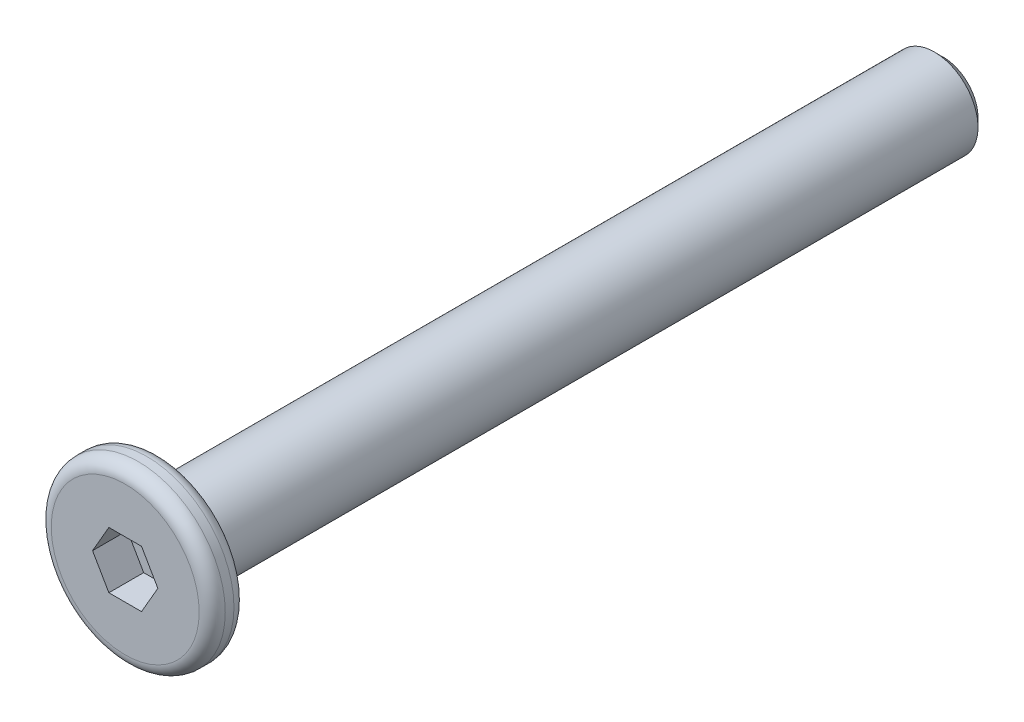
ISO-10303-21;
HEADER;
FILE_DESCRIPTION(('STEP AP214'),'2;1');
FILE_NAME('part.step','',(''),(''),'','','');
FILE_SCHEMA(('AUTOMOTIVE_DESIGN { 1 0 10303 214 1 1 1 1 }'));
ENDSEC;
DATA;
#1=APPLICATION_CONTEXT('core data for automotive mechanical design processes');
#2=APPLICATION_PROTOCOL_DEFINITION('international standard','automotive_design',2000,#1);
#3=PRODUCT_CONTEXT('',#1,'mechanical');
#4=PRODUCT('Part','Part','',(#3));
#5=PRODUCT_RELATED_PRODUCT_CATEGORY('part','',(#4));
#6=PRODUCT_DEFINITION_FORMATION('','',#4);
#7=PRODUCT_DEFINITION_CONTEXT('part definition',#1,'design');
#8=PRODUCT_DEFINITION('design','',#6,#7);
#9=PRODUCT_DEFINITION_SHAPE('','',#8);
#10=(LENGTH_UNIT() NAMED_UNIT(*) SI_UNIT(.MILLI.,.METRE.));
#11=(NAMED_UNIT(*) PLANE_ANGLE_UNIT() SI_UNIT($,.RADIAN.));
#12=(NAMED_UNIT(*) SI_UNIT($,.STERADIAN.) SOLID_ANGLE_UNIT());
#13=UNCERTAINTY_MEASURE_WITH_UNIT(LENGTH_MEASURE(1.E-05),#10,'distance_accuracy_value','');
#14=(GEOMETRIC_REPRESENTATION_CONTEXT(3) GLOBAL_UNCERTAINTY_ASSIGNED_CONTEXT((#13)) GLOBAL_UNIT_ASSIGNED_CONTEXT((#10,
#11,#12)) REPRESENTATION_CONTEXT('',''));
#15=CARTESIAN_POINT('',(0.,0.,0.));
#16=DIRECTION('',(0.,0.,1.));
#17=DIRECTION('',(1.,0.,0.));
#18=AXIS2_PLACEMENT_3D('',#15,#16,#17);
#19=CARTESIAN_POINT('',(0.,0.,0.4));
#20=DIRECTION('',(0.,0.,-1.));
#21=DIRECTION('',(-1.,0.,0.));
#22=AXIS2_PLACEMENT_3D('',#19,#20,#21);
#23=CYLINDRICAL_SURFACE('',#22,2.);
#24=CARTESIAN_POINT('',(0.,0.,-0.1));
#25=DIRECTION('',(0.,0.,1.));
#26=DIRECTION('',(1.,0.,0.));
#27=AXIS2_PLACEMENT_3D('',#24,#25,#26);
#28=CIRCLE('',#27,2.);
#29=CARTESIAN_POINT('',(2.,0.,-0.1));
#30=VERTEX_POINT('',#29);
#31=EDGE_CURVE('E153',#30,#30,#28,.T.);
#32=ORIENTED_EDGE('',*,*,#31,.T.);
#33=EDGE_LOOP('',(#32));
#34=FACE_BOUND('',#33,.T.);
#35=CARTESIAN_POINT('',(0.,0.,0.1));
#36=DIRECTION('',(0.,0.,1.));
#37=DIRECTION('',(1.,0.,0.));
#38=AXIS2_PLACEMENT_3D('',#35,#36,#37);
#39=CIRCLE('',#38,2.);
#40=CARTESIAN_POINT('',(2.,0.,0.1));
#41=VERTEX_POINT('',#40);
#42=EDGE_CURVE('E150',#41,#41,#39,.F.);
#43=ORIENTED_EDGE('',*,*,#42,.T.);
#44=EDGE_LOOP('',(#43));
#45=FACE_BOUND('',#44,.T.);
#46=ADVANCED_FACE('F34',(#34,#45),#23,.T.);
#47=CARTESIAN_POINT('',(0.,0.,0.4));
#48=DIRECTION('',(0.,0.,1.));
#49=DIRECTION('',(1.,0.,0.));
#50=AXIS2_PLACEMENT_3D('',#47,#48,#49);
#51=PLANE('',#50);
#52=CARTESIAN_POINT('',(0.,0.,0.4));
#53=DIRECTION('',(0.,0.,1.));
#54=DIRECTION('',(1.,0.,0.));
#55=AXIS2_PLACEMENT_3D('',#52,#53,#54);
#56=CIRCLE('',#55,1.7);
#57=CARTESIAN_POINT('',(1.7,0.,0.4));
#58=VERTEX_POINT('',#57);
#59=EDGE_CURVE('E11',#58,#58,#56,.T.);
#60=ORIENTED_EDGE('',*,*,#59,.T.);
#61=EDGE_LOOP('',(#60));
#62=FACE_BOUND('',#61,.T.);
#63=DIRECTION('',(0.5,0.866025403784439,0.));
#64=VECTOR('',#63,1.);
#65=CARTESIAN_POINT('',(0.375277674973257,-0.65,0.4));
#66=LINE('',#65,#64);
#67=CARTESIAN_POINT('',(0.375277674973257,-0.65,0.4));
#68=VERTEX_POINT('',#67);
#69=CARTESIAN_POINT('',(0.750555349946514,0.,0.4));
#70=VERTEX_POINT('',#69);
#71=EDGE_CURVE('E49',#68,#70,#66,.T.);
#72=ORIENTED_EDGE('',*,*,#71,.F.);
#73=DIRECTION('',(1.,0.,0.));
#74=VECTOR('',#73,1.);
#75=CARTESIAN_POINT('',(-0.375277674973256,-0.65,0.4));
#76=LINE('',#75,#74);
#77=CARTESIAN_POINT('',(-0.375277674973256,-0.65,0.4));
#78=VERTEX_POINT('',#77);
#79=EDGE_CURVE('E132',#78,#68,#76,.T.);
#80=ORIENTED_EDGE('',*,*,#79,.F.);
#81=DIRECTION('',(0.5,-0.866025403784438,0.));
#82=VECTOR('',#81,1.);
#83=CARTESIAN_POINT('',(-0.750555349946513,0.,0.4));
#84=LINE('',#83,#82);
#85=CARTESIAN_POINT('',(-0.750555349946513,0.,0.4));
#86=VERTEX_POINT('',#85);
#87=EDGE_CURVE('E130',#86,#78,#84,.T.);
#88=ORIENTED_EDGE('',*,*,#87,.F.);
#89=DIRECTION('',(-0.5,-0.866025403784439,0.));
#90=VECTOR('',#89,1.);
#91=CARTESIAN_POINT('',(-0.375277674973257,0.65,0.4));
#92=LINE('',#91,#90);
#93=CARTESIAN_POINT('',(-0.375277674973257,0.65,0.4));
#94=VERTEX_POINT('',#93);
#95=EDGE_CURVE('E97',#94,#86,#92,.T.);
#96=ORIENTED_EDGE('',*,*,#95,.F.);
#97=DIRECTION('',(-1.,0.,0.));
#98=VECTOR('',#97,1.);
#99=CARTESIAN_POINT('',(0.375277674973257,0.65,0.4));
#100=LINE('',#99,#98);
#101=CARTESIAN_POINT('',(0.375277674973257,0.65,0.4));
#102=VERTEX_POINT('',#101);
#103=EDGE_CURVE('E126',#102,#94,#100,.T.);
#104=ORIENTED_EDGE('',*,*,#103,.F.);
#105=DIRECTION('',(-0.5,0.866025403784439,0.));
#106=VECTOR('',#105,1.);
#107=CARTESIAN_POINT('',(0.750555349946514,0.,0.4));
#108=LINE('',#107,#106);
#109=EDGE_CURVE('E123',#70,#102,#108,.T.);
#110=ORIENTED_EDGE('',*,*,#109,.F.);
#111=EDGE_LOOP('',(#72,#80,#88,#96,#104,#110));
#112=FACE_BOUND('',#111,.T.);
#113=ADVANCED_FACE('F168',(#62,#112),#51,.T.);
#114=CARTESIAN_POINT('',(0.,0.,-0.4));
#115=DIRECTION('',(0.,0.,1.));
#116=DIRECTION('',(1.,0.,0.));
#117=AXIS2_PLACEMENT_3D('',#114,#115,#116);
#118=PLANE('',#117);
#119=CARTESIAN_POINT('',(0.,0.,-0.4));
#120=DIRECTION('',(0.,0.,1.));
#121=DIRECTION('',(1.,0.,0.));
#122=AXIS2_PLACEMENT_3D('',#119,#120,#121);
#123=CIRCLE('',#122,1.7);
#124=CARTESIAN_POINT('',(1.7,0.,-0.4));
#125=VERTEX_POINT('',#124);
#126=EDGE_CURVE('E42',#125,#125,#123,.F.);
#127=ORIENTED_EDGE('',*,*,#126,.T.);
#128=EDGE_LOOP('',(#127));
#129=FACE_BOUND('',#128,.T.);
#130=CARTESIAN_POINT('',(0.,0.,-0.4));
#131=DIRECTION('',(0.,0.,-1.));
#132=DIRECTION('',(-1.,0.,0.));
#133=AXIS2_PLACEMENT_3D('',#130,#131,#132);
#134=CIRCLE('',#133,1.);
#135=CARTESIAN_POINT('',(-1.,0.,-0.4));
#136=VERTEX_POINT('',#135);
#137=EDGE_CURVE('E136',#136,#136,#134,.T.);
#138=ORIENTED_EDGE('',*,*,#137,.F.);
#139=EDGE_LOOP('',(#138));
#140=FACE_BOUND('',#139,.T.);
#141=ADVANCED_FACE('F158',(#129,#140),#118,.F.);
#142=CARTESIAN_POINT('',(0.,0.,-18.4));
#143=DIRECTION('',(0.,0.,1.));
#144=DIRECTION('',(1.,0.,0.));
#145=AXIS2_PLACEMENT_3D('',#142,#143,#144);
#146=CYLINDRICAL_SURFACE('',#145,1.);
#147=CARTESIAN_POINT('',(0.,0.,-18.2));
#148=DIRECTION('',(0.,0.,-1.));
#149=DIRECTION('',(-1.,0.,0.));
#150=AXIS2_PLACEMENT_3D('',#147,#148,#149);
#151=CIRCLE('',#150,1.);
#152=CARTESIAN_POINT('',(-1.,0.,-18.2));
#153=VERTEX_POINT('',#152);
#154=EDGE_CURVE('E147',#153,#153,#151,.F.);
#155=ORIENTED_EDGE('',*,*,#154,.T.);
#156=EDGE_LOOP('',(#155));
#157=FACE_BOUND('',#156,.T.);
#158=ORIENTED_EDGE('',*,*,#137,.T.);
#159=EDGE_LOOP('',(#158));
#160=FACE_BOUND('',#159,.T.);
#161=ADVANCED_FACE('F203',(#157,#160),#146,.T.);
#162=CARTESIAN_POINT('',(0.,0.,-18.4));
#163=DIRECTION('',(0.,0.,-1.));
#164=DIRECTION('',(-1.,0.,0.));
#165=AXIS2_PLACEMENT_3D('',#162,#163,#164);
#166=PLANE('',#165);
#167=CARTESIAN_POINT('',(0.,0.,-18.4));
#168=DIRECTION('',(0.,0.,-1.));
#169=DIRECTION('',(-1.,0.,0.));
#170=AXIS2_PLACEMENT_3D('',#167,#168,#169);
#171=CIRCLE('',#170,0.799999999999999);
#172=CARTESIAN_POINT('',(-0.799999999999999,0.,-18.4));
#173=VERTEX_POINT('',#172);
#174=EDGE_CURVE('E144',#173,#173,#171,.T.);
#175=ORIENTED_EDGE('',*,*,#174,.T.);
#176=EDGE_LOOP('',(#175));
#177=FACE_BOUND('',#176,.T.);
#178=ADVANCED_FACE('F195',(#177),#166,.T.);
#179=CARTESIAN_POINT('',(0.,0.,-18.4));
#180=DIRECTION('',(0.,0.,1.));
#181=DIRECTION('',(1.,0.,0.));
#182=AXIS2_PLACEMENT_3D('',#179,#180,#181);
#183=CONICAL_SURFACE('',#182,0.799999999999999,0.785398163397446);
#184=ORIENTED_EDGE('',*,*,#154,.F.);
#185=EDGE_LOOP('',(#184));
#186=FACE_BOUND('',#185,.T.);
#187=ORIENTED_EDGE('',*,*,#174,.F.);
#188=EDGE_LOOP('',(#187));
#189=FACE_BOUND('',#188,.T.);
#190=ADVANCED_FACE('F188',(#186,#189),#183,.T.);
#191=CARTESIAN_POINT('',(0.375277674973257,-0.65,-0.4));
#192=DIRECTION('',(0.866025403784439,-0.5,0.));
#193=DIRECTION('',(0.5,0.866025403784439,0.));
#194=AXIS2_PLACEMENT_3D('',#191,#192,#193);
#195=PLANE('',#194);
#196=ORIENTED_EDGE('',*,*,#71,.T.);
#197=DIRECTION('',(0.,0.,1.));
#198=VECTOR('',#197,1.);
#199=CARTESIAN_POINT('',(0.750555349946514,0.,-0.4));
#200=LINE('',#199,#198);
#201=CARTESIAN_POINT('',(0.750555349946514,0.,-0.4));
#202=VERTEX_POINT('',#201);
#203=EDGE_CURVE('E79',#202,#70,#200,.T.);
#204=ORIENTED_EDGE('',*,*,#203,.F.);
#205=DIRECTION('',(0.5,0.866025403784439,0.));
#206=VECTOR('',#205,1.);
#207=CARTESIAN_POINT('',(0.375277674973257,-0.65,-0.4));
#208=LINE('',#207,#206);
#209=CARTESIAN_POINT('',(0.375277674973257,-0.65,-0.4));
#210=VERTEX_POINT('',#209);
#211=EDGE_CURVE('E134',#210,#202,#208,.T.);
#212=ORIENTED_EDGE('',*,*,#211,.F.);
#213=DIRECTION('',(0.,0.,1.));
#214=VECTOR('',#213,1.);
#215=CARTESIAN_POINT('',(0.375277674973257,-0.65,-0.4));
#216=LINE('',#215,#214);
#217=EDGE_CURVE('E57',#210,#68,#216,.T.);
#218=ORIENTED_EDGE('',*,*,#217,.T.);
#219=EDGE_LOOP('',(#196,#204,#212,#218));
#220=FACE_BOUND('',#219,.T.);
#221=ADVANCED_FACE('F185',(#220),#195,.F.);
#222=CARTESIAN_POINT('',(-0.375277674973256,-0.65,-0.4));
#223=DIRECTION('',(0.,-1.,0.));
#224=DIRECTION('',(1.,0.,0.));
#225=AXIS2_PLACEMENT_3D('',#222,#223,#224);
#226=PLANE('',#225);
#227=ORIENTED_EDGE('',*,*,#79,.T.);
#228=ORIENTED_EDGE('',*,*,#217,.F.);
#229=DIRECTION('',(1.,0.,0.));
#230=VECTOR('',#229,1.);
#231=CARTESIAN_POINT('',(-0.375277674973256,-0.65,-0.4));
#232=LINE('',#231,#230);
#233=CARTESIAN_POINT('',(-0.375277674973256,-0.65,-0.4));
#234=VERTEX_POINT('',#233);
#235=EDGE_CURVE('E109',#234,#210,#232,.T.);
#236=ORIENTED_EDGE('',*,*,#235,.F.);
#237=DIRECTION('',(0.,0.,1.));
#238=VECTOR('',#237,1.);
#239=CARTESIAN_POINT('',(-0.375277674973256,-0.65,-0.4));
#240=LINE('',#239,#238);
#241=EDGE_CURVE('E101',#234,#78,#240,.T.);
#242=ORIENTED_EDGE('',*,*,#241,.T.);
#243=EDGE_LOOP('',(#227,#228,#236,#242));
#244=FACE_BOUND('',#243,.T.);
#245=ADVANCED_FACE('F187',(#244),#226,.F.);
#246=CARTESIAN_POINT('',(-0.750555349946513,0.,-0.4));
#247=DIRECTION('',(-0.866025403784438,-0.5,0.));
#248=DIRECTION('',(0.5,-0.866025403784439,0.));
#249=AXIS2_PLACEMENT_3D('',#246,#247,#248);
#250=PLANE('',#249);
#251=ORIENTED_EDGE('',*,*,#87,.T.);
#252=ORIENTED_EDGE('',*,*,#241,.F.);
#253=DIRECTION('',(0.5,-0.866025403784438,0.));
#254=VECTOR('',#253,1.);
#255=CARTESIAN_POINT('',(-0.750555349946513,0.,-0.4));
#256=LINE('',#255,#254);
#257=CARTESIAN_POINT('',(-0.750555349946513,0.,-0.4));
#258=VERTEX_POINT('',#257);
#259=EDGE_CURVE('E105',#258,#234,#256,.T.);
#260=ORIENTED_EDGE('',*,*,#259,.F.);
#261=DIRECTION('',(0.,0.,1.));
#262=VECTOR('',#261,1.);
#263=CARTESIAN_POINT('',(-0.750555349946513,0.,-0.4));
#264=LINE('',#263,#262);
#265=EDGE_CURVE('E90',#258,#86,#264,.T.);
#266=ORIENTED_EDGE('',*,*,#265,.T.);
#267=EDGE_LOOP('',(#251,#252,#260,#266));
#268=FACE_BOUND('',#267,.T.);
#269=ADVANCED_FACE('F106',(#268),#250,.F.);
#270=CARTESIAN_POINT('',(-0.375277674973257,0.65,-0.4));
#271=DIRECTION('',(-0.866025403784439,0.5,0.));
#272=DIRECTION('',(-0.5,-0.866025403784439,0.));
#273=AXIS2_PLACEMENT_3D('',#270,#271,#272);
#274=PLANE('',#273);
#275=ORIENTED_EDGE('',*,*,#95,.T.);
#276=ORIENTED_EDGE('',*,*,#265,.F.);
#277=DIRECTION('',(-0.5,-0.866025403784439,0.));
#278=VECTOR('',#277,1.);
#279=CARTESIAN_POINT('',(-0.375277674973257,0.65,-0.4));
#280=LINE('',#279,#278);
#281=CARTESIAN_POINT('',(-0.375277674973257,0.65,-0.4));
#282=VERTEX_POINT('',#281);
#283=EDGE_CURVE('E94',#282,#258,#280,.T.);
#284=ORIENTED_EDGE('',*,*,#283,.F.);
#285=DIRECTION('',(0.,0.,1.));
#286=VECTOR('',#285,1.);
#287=CARTESIAN_POINT('',(-0.375277674973257,0.65,-0.4));
#288=LINE('',#287,#286);
#289=EDGE_CURVE('E102',#282,#94,#288,.T.);
#290=ORIENTED_EDGE('',*,*,#289,.T.);
#291=EDGE_LOOP('',(#275,#276,#284,#290));
#292=FACE_BOUND('',#291,.T.);
#293=ADVANCED_FACE('F92',(#292),#274,.F.);
#294=CARTESIAN_POINT('',(0.375277674973257,0.65,-0.4));
#295=DIRECTION('',(0.,1.,0.));
#296=DIRECTION('',(0.,0.,1.));
#297=AXIS2_PLACEMENT_3D('',#294,#295,#296);
#298=PLANE('',#297);
#299=ORIENTED_EDGE('',*,*,#103,.T.);
#300=ORIENTED_EDGE('',*,*,#289,.F.);
#301=DIRECTION('',(-1.,0.,0.));
#302=VECTOR('',#301,1.);
#303=CARTESIAN_POINT('',(0.375277674973257,0.65,-0.4));
#304=LINE('',#303,#302);
#305=CARTESIAN_POINT('',(0.375277674973257,0.65,-0.4));
#306=VERTEX_POINT('',#305);
#307=EDGE_CURVE('E115',#306,#282,#304,.T.);
#308=ORIENTED_EDGE('',*,*,#307,.F.);
#309=DIRECTION('',(0.,0.,1.));
#310=VECTOR('',#309,1.);
#311=CARTESIAN_POINT('',(0.375277674973257,0.65,-0.4));
#312=LINE('',#311,#310);
#313=EDGE_CURVE('E139',#306,#102,#312,.T.);
#314=ORIENTED_EDGE('',*,*,#313,.T.);
#315=EDGE_LOOP('',(#299,#300,#308,#314));
#316=FACE_BOUND('',#315,.T.);
#317=ADVANCED_FACE('F256',(#316),#298,.F.);
#318=CARTESIAN_POINT('',(0.750555349946514,0.,-0.4));
#319=DIRECTION('',(0.866025403784439,0.5,0.));
#320=DIRECTION('',(-0.5,0.866025403784439,0.));
#321=AXIS2_PLACEMENT_3D('',#318,#319,#320);
#322=PLANE('',#321);
#323=ORIENTED_EDGE('',*,*,#109,.T.);
#324=ORIENTED_EDGE('',*,*,#313,.F.);
#325=DIRECTION('',(-0.5,0.866025403784439,0.));
#326=VECTOR('',#325,1.);
#327=CARTESIAN_POINT('',(0.750555349946514,0.,-0.4));
#328=LINE('',#327,#326);
#329=EDGE_CURVE('E117',#202,#306,#328,.T.);
#330=ORIENTED_EDGE('',*,*,#329,.F.);
#331=ORIENTED_EDGE('',*,*,#203,.T.);
#332=EDGE_LOOP('',(#323,#324,#330,#331));
#333=FACE_BOUND('',#332,.T.);
#334=ADVANCED_FACE('F183',(#333),#322,.F.);
#335=CARTESIAN_POINT('',(0.,0.,-0.4));
#336=DIRECTION('',(0.,0.,1.));
#337=DIRECTION('',(1.,0.,0.));
#338=AXIS2_PLACEMENT_3D('',#335,#336,#337);
#339=PLANE('',#338);
#340=ORIENTED_EDGE('',*,*,#211,.T.);
#341=ORIENTED_EDGE('',*,*,#329,.T.);
#342=ORIENTED_EDGE('',*,*,#307,.T.);
#343=ORIENTED_EDGE('',*,*,#283,.T.);
#344=ORIENTED_EDGE('',*,*,#259,.T.);
#345=ORIENTED_EDGE('',*,*,#235,.T.);
#346=EDGE_LOOP('',(#340,#341,#342,#343,#344,#345));
#347=FACE_BOUND('',#346,.T.);
#348=ADVANCED_FACE('F112',(#347),#339,.T.);
#349=CARTESIAN_POINT('',(0.,0.,-0.1));
#350=DIRECTION('',(0.,0.,1.));
#351=DIRECTION('',(1.,0.,0.));
#352=AXIS2_PLACEMENT_3D('',#349,#350,#351);
#353=TOROIDAL_SURFACE('',#352,1.7,0.3);
#354=ORIENTED_EDGE('',*,*,#126,.F.);
#355=EDGE_LOOP('',(#354));
#356=FACE_BOUND('',#355,.T.);
#357=ORIENTED_EDGE('',*,*,#31,.F.);
#358=EDGE_LOOP('',(#357));
#359=FACE_BOUND('',#358,.T.);
#360=ADVANCED_FACE('F161',(#356,#359),#353,.T.);
#361=CARTESIAN_POINT('',(0.,0.,0.1));
#362=DIRECTION('',(0.,0.,1.));
#363=DIRECTION('',(1.,0.,0.));
#364=AXIS2_PLACEMENT_3D('',#361,#362,#363);
#365=TOROIDAL_SURFACE('',#364,1.7,0.3);
#366=ORIENTED_EDGE('',*,*,#42,.F.);
#367=EDGE_LOOP('',(#366));
#368=FACE_BOUND('',#367,.T.);
#369=ORIENTED_EDGE('',*,*,#59,.F.);
#370=EDGE_LOOP('',(#369));
#371=FACE_BOUND('',#370,.T.);
#372=ADVANCED_FACE('F36',(#368,#371),#365,.T.);
#373=CLOSED_SHELL('',(#46,#113,#141,#161,#178,#190,#221,#245,#269,#293,#317,#334,#348,#360,#372));
#374=MANIFOLD_SOLID_BREP('B2',#373);
#375=ADVANCED_BREP_SHAPE_REPRESENTATION('',(#18,#374),#14);
#376=SHAPE_DEFINITION_REPRESENTATION(#9,#375);
ENDSEC;
END-ISO-10303-21;
